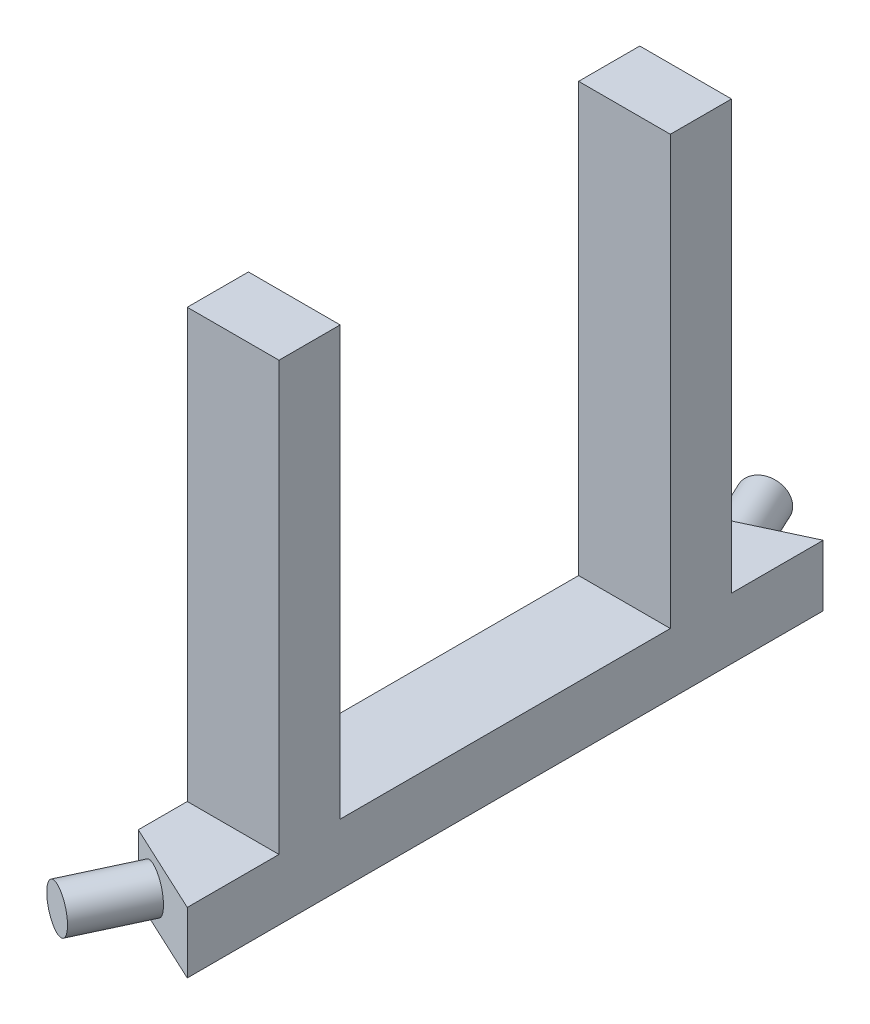
ISO-10303-21;
HEADER;
FILE_DESCRIPTION(('STEP AP214'),'2;1');
FILE_NAME('part.step','',(''),(''),'','','');
FILE_SCHEMA(('AUTOMOTIVE_DESIGN { 1 0 10303 214 1 1 1 1 }'));
ENDSEC;
DATA;
#1=APPLICATION_CONTEXT('core data for automotive mechanical design processes');
#2=APPLICATION_PROTOCOL_DEFINITION('international standard','automotive_design',2000,#1);
#3=PRODUCT_CONTEXT('',#1,'mechanical');
#4=PRODUCT('Part','Part','',(#3));
#5=PRODUCT_RELATED_PRODUCT_CATEGORY('part','',(#4));
#6=PRODUCT_DEFINITION_FORMATION('','',#4);
#7=PRODUCT_DEFINITION_CONTEXT('part definition',#1,'design');
#8=PRODUCT_DEFINITION('design','',#6,#7);
#9=PRODUCT_DEFINITION_SHAPE('','',#8);
#10=(LENGTH_UNIT() NAMED_UNIT(*) SI_UNIT(.MILLI.,.METRE.));
#11=(NAMED_UNIT(*) PLANE_ANGLE_UNIT() SI_UNIT($,.RADIAN.));
#12=(NAMED_UNIT(*) SI_UNIT($,.STERADIAN.) SOLID_ANGLE_UNIT());
#13=UNCERTAINTY_MEASURE_WITH_UNIT(LENGTH_MEASURE(1.E-05),#10,'distance_accuracy_value','');
#14=(GEOMETRIC_REPRESENTATION_CONTEXT(3) GLOBAL_UNCERTAINTY_ASSIGNED_CONTEXT((#13)) GLOBAL_UNIT_ASSIGNED_CONTEXT((#10,
#11,#12)) REPRESENTATION_CONTEXT('',''));
#15=CARTESIAN_POINT('',(0.,0.,0.));
#16=DIRECTION('',(0.,0.,1.));
#17=DIRECTION('',(1.,0.,0.));
#18=AXIS2_PLACEMENT_3D('',#15,#16,#17);
#19=CARTESIAN_POINT('',(0.,25.4,132.08));
#20=DIRECTION('',(0.,-1.,0.));
#21=DIRECTION('',(0.,0.,-1.));
#22=AXIS2_PLACEMENT_3D('',#19,#20,#21);
#23=PLANE('',#22);
#24=DIRECTION('',(-0.906307787036652,0.,0.422618261740694));
#25=VECTOR('',#24,1.);
#26=CARTESIAN_POINT('',(-12.1060333579969,25.4,-108.668542159581));
#27=LINE('',#26,#25);
#28=CARTESIAN_POINT('',(38.1,25.4,-132.08));
#29=VERTEX_POINT('',#28);
#30=CARTESIAN_POINT('',(0.,25.4,-114.313678224295));
#31=VERTEX_POINT('',#30);
#32=EDGE_CURVE('E132',#29,#31,#27,.T.);
#33=ORIENTED_EDGE('',*,*,#32,.T.);
#34=DIRECTION('',(0.,0.,-1.));
#35=VECTOR('',#34,1.);
#36=CARTESIAN_POINT('',(0.,25.4,132.08));
#37=LINE('',#36,#35);
#38=CARTESIAN_POINT('',(0.,25.4,-93.98));
#39=VERTEX_POINT('',#38);
#40=EDGE_CURVE('E55',#39,#31,#37,.T.);
#41=ORIENTED_EDGE('',*,*,#40,.F.);
#42=DIRECTION('',(1.,0.,0.));
#43=VECTOR('',#42,1.);
#44=CARTESIAN_POINT('',(38.1,25.4,-93.98));
#45=LINE('',#44,#43);
#46=CARTESIAN_POINT('',(38.1,25.4,-93.98));
#47=VERTEX_POINT('',#46);
#48=EDGE_CURVE('E223',#39,#47,#45,.T.);
#49=ORIENTED_EDGE('',*,*,#48,.T.);
#50=DIRECTION('',(0.,0.,-1.));
#51=VECTOR('',#50,1.);
#52=CARTESIAN_POINT('',(38.1,25.4,132.08));
#53=LINE('',#52,#51);
#54=EDGE_CURVE('E141',#47,#29,#53,.T.);
#55=ORIENTED_EDGE('',*,*,#54,.T.);
#56=EDGE_LOOP('',(#33,#41,#49,#55));
#57=FACE_BOUND('',#56,.T.);
#58=ADVANCED_FACE('F39',(#57),#23,.F.);
#59=CARTESIAN_POINT('',(0.,0.,132.08));
#60=DIRECTION('',(1.,0.,0.));
#61=DIRECTION('',(0.,1.,0.));
#62=AXIS2_PLACEMENT_3D('',#59,#60,#61);
#63=PLANE('',#62);
#64=DIRECTION('',(0.,-1.,0.));
#65=VECTOR('',#64,1.);
#66=CARTESIAN_POINT('',(0.,-0.000999999999998987,-114.313678224295));
#67=LINE('',#66,#65);
#68=CARTESIAN_POINT('',(0.,0.,-114.313678224295));
#69=VERTEX_POINT('',#68);
#70=EDGE_CURVE('E130',#31,#69,#67,.T.);
#71=ORIENTED_EDGE('',*,*,#70,.T.);
#72=DIRECTION('',(0.,0.,-1.));
#73=VECTOR('',#72,1.);
#74=CARTESIAN_POINT('',(0.,0.,132.08));
#75=LINE('',#74,#73);
#76=CARTESIAN_POINT('',(0.,0.,114.313678224295));
#77=VERTEX_POINT('',#76);
#78=EDGE_CURVE('E43',#77,#69,#75,.T.);
#79=ORIENTED_EDGE('',*,*,#78,.F.);
#80=DIRECTION('',(0.,-1.,0.));
#81=VECTOR('',#80,1.);
#82=CARTESIAN_POINT('',(0.,-0.000999999999998987,114.313678224295));
#83=LINE('',#82,#81);
#84=CARTESIAN_POINT('',(0.,25.4,114.313678224295));
#85=VERTEX_POINT('',#84);
#86=EDGE_CURVE('E173',#85,#77,#83,.T.);
#87=ORIENTED_EDGE('',*,*,#86,.F.);
#88=CARTESIAN_POINT('',(0.,25.4,93.98));
#89=VERTEX_POINT('',#88);
#90=EDGE_CURVE('E150',#85,#89,#37,.T.);
#91=ORIENTED_EDGE('',*,*,#90,.T.);
#92=DIRECTION('',(0.,-1.,0.));
#93=VECTOR('',#92,1.);
#94=CARTESIAN_POINT('',(0.,203.2,93.98));
#95=LINE('',#94,#93);
#96=CARTESIAN_POINT('',(0.,203.2,93.98));
#97=VERTEX_POINT('',#96);
#98=EDGE_CURVE('E151',#97,#89,#95,.T.);
#99=ORIENTED_EDGE('',*,*,#98,.F.);
#100=DIRECTION('',(0.,0.,1.));
#101=VECTOR('',#100,1.);
#102=CARTESIAN_POINT('',(0.,203.2,93.98));
#103=LINE('',#102,#101);
#104=CARTESIAN_POINT('',(0.,203.2,68.58));
#105=VERTEX_POINT('',#104);
#106=EDGE_CURVE('E202',#105,#97,#103,.T.);
#107=ORIENTED_EDGE('',*,*,#106,.F.);
#108=DIRECTION('',(0.,-1.,0.));
#109=VECTOR('',#108,1.);
#110=CARTESIAN_POINT('',(0.,203.2,68.58));
#111=LINE('',#110,#109);
#112=CARTESIAN_POINT('',(0.,25.4,68.58));
#113=VERTEX_POINT('',#112);
#114=EDGE_CURVE('E197',#105,#113,#111,.T.);
#115=ORIENTED_EDGE('',*,*,#114,.T.);
#116=CARTESIAN_POINT('',(0.,25.4,-68.58));
#117=VERTEX_POINT('',#116);
#118=EDGE_CURVE('E147',#113,#117,#37,.T.);
#119=ORIENTED_EDGE('',*,*,#118,.T.);
#120=DIRECTION('',(0.,-1.,0.));
#121=VECTOR('',#120,1.);
#122=CARTESIAN_POINT('',(0.,203.2,-68.58));
#123=LINE('',#122,#121);
#124=CARTESIAN_POINT('',(0.,203.2,-68.58));
#125=VERTEX_POINT('',#124);
#126=EDGE_CURVE('E212',#125,#117,#123,.T.);
#127=ORIENTED_EDGE('',*,*,#126,.F.);
#128=DIRECTION('',(0.,0.,-1.));
#129=VECTOR('',#128,1.);
#130=CARTESIAN_POINT('',(0.,203.2,-93.98));
#131=LINE('',#130,#129);
#132=CARTESIAN_POINT('',(0.,203.2,-93.98));
#133=VERTEX_POINT('',#132);
#134=EDGE_CURVE('E225',#125,#133,#131,.T.);
#135=ORIENTED_EDGE('',*,*,#134,.T.);
#136=DIRECTION('',(0.,-1.,0.));
#137=VECTOR('',#136,1.);
#138=CARTESIAN_POINT('',(0.,203.2,-93.98));
#139=LINE('',#138,#137);
#140=EDGE_CURVE('E145',#133,#39,#139,.T.);
#141=ORIENTED_EDGE('',*,*,#140,.T.);
#142=ORIENTED_EDGE('',*,*,#40,.T.);
#143=EDGE_LOOP('',(#71,#79,#87,#91,#99,#107,#115,#119,#127,#135,#141,#142));
#144=FACE_BOUND('',#143,.T.);
#145=ADVANCED_FACE('F41',(#144),#63,.F.);
#146=CARTESIAN_POINT('',(0.,0.,132.08));
#147=DIRECTION('',(0.,1.,0.));
#148=DIRECTION('',(0.,0.,1.));
#149=AXIS2_PLACEMENT_3D('',#146,#147,#148);
#150=PLANE('',#149);
#151=DIRECTION('',(0.906307787036653,0.,-0.422618261740694));
#152=VECTOR('',#151,1.);
#153=CARTESIAN_POINT('',(-12.1060333579969,0.,-108.668542159581));
#154=LINE('',#153,#152);
#155=CARTESIAN_POINT('',(38.1,0.,-132.08));
#156=VERTEX_POINT('',#155);
#157=EDGE_CURVE('E135',#69,#156,#154,.T.);
#158=ORIENTED_EDGE('',*,*,#157,.T.);
#159=DIRECTION('',(0.,0.,-1.));
#160=VECTOR('',#159,1.);
#161=CARTESIAN_POINT('',(38.1,0.,132.08));
#162=LINE('',#161,#160);
#163=CARTESIAN_POINT('',(38.1,0.,132.08));
#164=VERTEX_POINT('',#163);
#165=EDGE_CURVE('E160',#164,#156,#162,.T.);
#166=ORIENTED_EDGE('',*,*,#165,.F.);
#167=DIRECTION('',(0.906307787036653,0.,0.422618261740694));
#168=VECTOR('',#167,1.);
#169=CARTESIAN_POINT('',(-12.1060333579969,0.,108.668542159581));
#170=LINE('',#169,#168);
#171=EDGE_CURVE('E172',#77,#164,#170,.T.);
#172=ORIENTED_EDGE('',*,*,#171,.F.);
#173=ORIENTED_EDGE('',*,*,#78,.T.);
#174=EDGE_LOOP('',(#158,#166,#172,#173));
#175=FACE_BOUND('',#174,.T.);
#176=ADVANCED_FACE('F171',(#175),#150,.F.);
#177=CARTESIAN_POINT('',(38.1,25.4,68.58));
#178=VERTEX_POINT('',#177);
#179=CARTESIAN_POINT('',(38.1,25.4,-68.58));
#180=VERTEX_POINT('',#179);
#181=EDGE_CURVE('E158',#178,#180,#53,.T.);
#182=ORIENTED_EDGE('',*,*,#181,.T.);
#183=DIRECTION('',(-1.,0.,0.));
#184=VECTOR('',#183,1.);
#185=CARTESIAN_POINT('',(38.1,25.4,-68.58));
#186=LINE('',#185,#184);
#187=EDGE_CURVE('E63',#180,#117,#186,.T.);
#188=ORIENTED_EDGE('',*,*,#187,.T.);
#189=ORIENTED_EDGE('',*,*,#118,.F.);
#190=DIRECTION('',(-1.,0.,0.));
#191=VECTOR('',#190,1.);
#192=CARTESIAN_POINT('',(38.1,25.4,68.58));
#193=LINE('',#192,#191);
#194=EDGE_CURVE('E184',#178,#113,#193,.T.);
#195=ORIENTED_EDGE('',*,*,#194,.F.);
#196=EDGE_LOOP('',(#182,#188,#189,#195));
#197=FACE_BOUND('',#196,.T.);
#198=ADVANCED_FACE('F259',(#197),#23,.F.);
#199=ORIENTED_EDGE('',*,*,#90,.F.);
#200=DIRECTION('',(-0.906307787036652,0.,-0.422618261740694));
#201=VECTOR('',#200,1.);
#202=CARTESIAN_POINT('',(-12.1060333579969,25.4,108.668542159581));
#203=LINE('',#202,#201);
#204=CARTESIAN_POINT('',(38.1,25.4,132.08));
#205=VERTEX_POINT('',#204);
#206=EDGE_CURVE('E175',#205,#85,#203,.T.);
#207=ORIENTED_EDGE('',*,*,#206,.F.);
#208=CARTESIAN_POINT('',(38.1,25.4,93.98));
#209=VERTEX_POINT('',#208);
#210=EDGE_CURVE('E159',#205,#209,#53,.T.);
#211=ORIENTED_EDGE('',*,*,#210,.T.);
#212=DIRECTION('',(1.,0.,0.));
#213=VECTOR('',#212,1.);
#214=CARTESIAN_POINT('',(38.1,25.4,93.98));
#215=LINE('',#214,#213);
#216=EDGE_CURVE('E179',#89,#209,#215,.T.);
#217=ORIENTED_EDGE('',*,*,#216,.F.);
#218=EDGE_LOOP('',(#199,#207,#211,#217));
#219=FACE_BOUND('',#218,.T.);
#220=ADVANCED_FACE('F178',(#219),#23,.F.);
#221=CARTESIAN_POINT('',(38.1,0.,132.08));
#222=DIRECTION('',(-1.,0.,0.));
#223=DIRECTION('',(0.,0.,1.));
#224=AXIS2_PLACEMENT_3D('',#221,#222,#223);
#225=PLANE('',#224);
#226=ORIENTED_EDGE('',*,*,#165,.T.);
#227=DIRECTION('',(0.,1.,0.));
#228=VECTOR('',#227,1.);
#229=CARTESIAN_POINT('',(38.1,0.,-132.08));
#230=LINE('',#229,#228);
#231=EDGE_CURVE('E176',#156,#29,#230,.T.);
#232=ORIENTED_EDGE('',*,*,#231,.T.);
#233=ORIENTED_EDGE('',*,*,#54,.F.);
#234=DIRECTION('',(0.,-1.,0.));
#235=VECTOR('',#234,1.);
#236=CARTESIAN_POINT('',(38.1,203.2,-93.98));
#237=LINE('',#236,#235);
#238=CARTESIAN_POINT('',(38.1,203.2,-93.98));
#239=VERTEX_POINT('',#238);
#240=EDGE_CURVE('E218',#239,#47,#237,.T.);
#241=ORIENTED_EDGE('',*,*,#240,.F.);
#242=DIRECTION('',(0.,0.,1.));
#243=VECTOR('',#242,1.);
#244=CARTESIAN_POINT('',(38.1,203.2,-93.98));
#245=LINE('',#244,#243);
#246=CARTESIAN_POINT('',(38.1,203.2,-68.58));
#247=VERTEX_POINT('',#246);
#248=EDGE_CURVE('E229',#239,#247,#245,.T.);
#249=ORIENTED_EDGE('',*,*,#248,.T.);
#250=DIRECTION('',(0.,-1.,0.));
#251=VECTOR('',#250,1.);
#252=CARTESIAN_POINT('',(38.1,203.2,-68.58));
#253=LINE('',#252,#251);
#254=EDGE_CURVE('E215',#247,#180,#253,.T.);
#255=ORIENTED_EDGE('',*,*,#254,.T.);
#256=ORIENTED_EDGE('',*,*,#181,.F.);
#257=DIRECTION('',(0.,-1.,0.));
#258=VECTOR('',#257,1.);
#259=CARTESIAN_POINT('',(38.1,203.2,68.58));
#260=LINE('',#259,#258);
#261=CARTESIAN_POINT('',(38.1,203.2,68.58));
#262=VERTEX_POINT('',#261);
#263=EDGE_CURVE('E192',#262,#178,#260,.T.);
#264=ORIENTED_EDGE('',*,*,#263,.F.);
#265=DIRECTION('',(0.,0.,-1.));
#266=VECTOR('',#265,1.);
#267=CARTESIAN_POINT('',(38.1,203.2,93.98));
#268=LINE('',#267,#266);
#269=CARTESIAN_POINT('',(38.1,203.2,93.98));
#270=VERTEX_POINT('',#269);
#271=EDGE_CURVE('E205',#270,#262,#268,.T.);
#272=ORIENTED_EDGE('',*,*,#271,.F.);
#273=DIRECTION('',(0.,-1.,0.));
#274=VECTOR('',#273,1.);
#275=CARTESIAN_POINT('',(38.1,203.2,93.98));
#276=LINE('',#275,#274);
#277=EDGE_CURVE('E190',#270,#209,#276,.T.);
#278=ORIENTED_EDGE('',*,*,#277,.T.);
#279=ORIENTED_EDGE('',*,*,#210,.F.);
#280=DIRECTION('',(0.,1.,0.));
#281=VECTOR('',#280,1.);
#282=CARTESIAN_POINT('',(38.1,0.,132.08));
#283=LINE('',#282,#281);
#284=EDGE_CURVE('E148',#164,#205,#283,.T.);
#285=ORIENTED_EDGE('',*,*,#284,.F.);
#286=EDGE_LOOP('',(#226,#232,#233,#241,#249,#255,#256,#264,#272,#278,#279,#285));
#287=FACE_BOUND('',#286,.T.);
#288=ADVANCED_FACE('F267',(#287),#225,.F.);
#289=CARTESIAN_POINT('',(38.1,203.2,93.98));
#290=DIRECTION('',(0.,0.,-1.));
#291=DIRECTION('',(-1.,0.,0.));
#292=AXIS2_PLACEMENT_3D('',#289,#290,#291);
#293=PLANE('',#292);
#294=ORIENTED_EDGE('',*,*,#216,.T.);
#295=ORIENTED_EDGE('',*,*,#277,.F.);
#296=DIRECTION('',(1.,0.,0.));
#297=VECTOR('',#296,1.);
#298=CARTESIAN_POINT('',(38.1,203.2,93.98));
#299=LINE('',#298,#297);
#300=EDGE_CURVE('E187',#97,#270,#299,.T.);
#301=ORIENTED_EDGE('',*,*,#300,.F.);
#302=ORIENTED_EDGE('',*,*,#98,.T.);
#303=EDGE_LOOP('',(#294,#295,#301,#302));
#304=FACE_BOUND('',#303,.T.);
#305=ADVANCED_FACE('F186',(#304),#293,.F.);
#306=CARTESIAN_POINT('',(38.1,203.2,68.58));
#307=DIRECTION('',(0.,0.,1.));
#308=DIRECTION('',(1.,0.,0.));
#309=AXIS2_PLACEMENT_3D('',#306,#307,#308);
#310=PLANE('',#309);
#311=ORIENTED_EDGE('',*,*,#194,.T.);
#312=ORIENTED_EDGE('',*,*,#114,.F.);
#313=DIRECTION('',(-1.,0.,0.));
#314=VECTOR('',#313,1.);
#315=CARTESIAN_POINT('',(38.1,203.2,68.58));
#316=LINE('',#315,#314);
#317=EDGE_CURVE('E200',#262,#105,#316,.T.);
#318=ORIENTED_EDGE('',*,*,#317,.F.);
#319=ORIENTED_EDGE('',*,*,#263,.T.);
#320=EDGE_LOOP('',(#311,#312,#318,#319));
#321=FACE_BOUND('',#320,.T.);
#322=ADVANCED_FACE('F274',(#321),#310,.F.);
#323=CARTESIAN_POINT('',(0.,203.2,0.));
#324=DIRECTION('',(0.,1.,0.));
#325=DIRECTION('',(0.,0.,1.));
#326=AXIS2_PLACEMENT_3D('',#323,#324,#325);
#327=PLANE('',#326);
#328=ORIENTED_EDGE('',*,*,#106,.T.);
#329=ORIENTED_EDGE('',*,*,#300,.T.);
#330=ORIENTED_EDGE('',*,*,#271,.T.);
#331=ORIENTED_EDGE('',*,*,#317,.T.);
#332=EDGE_LOOP('',(#328,#329,#330,#331));
#333=FACE_BOUND('',#332,.T.);
#334=ADVANCED_FACE('F335',(#333),#327,.T.);
#335=CARTESIAN_POINT('',(-12.1060333579969,-0.001000000000001,108.668542159581));
#336=DIRECTION('',(0.422618261740694,0.,-0.906307787036653));
#337=DIRECTION('',(-0.906307787036653,0.,-0.422618261740694));
#338=AXIS2_PLACEMENT_3D('',#335,#336,#337);
#339=PLANE('',#338);
#340=CARTESIAN_POINT('',(11.5101088953655,12.7,119.680930148402));
#341=DIRECTION('',(-0.422618261740694,0.,0.906307787036653));
#342=DIRECTION('',(0.906307787036653,0.,0.422618261740694));
#343=AXIS2_PLACEMENT_3D('',#340,#341,#342);
#344=CIRCLE('',#343,8.88999999999999);
#345=CARTESIAN_POINT('',(19.5671851221213,12.7,123.438006495276));
#346=VERTEX_POINT('',#345);
#347=EDGE_CURVE('E11',#346,#346,#344,.T.);
#348=ORIENTED_EDGE('',*,*,#347,.F.);
#349=EDGE_LOOP('',(#348));
#350=FACE_BOUND('',#349,.T.);
#351=ORIENTED_EDGE('',*,*,#86,.T.);
#352=ORIENTED_EDGE('',*,*,#171,.T.);
#353=ORIENTED_EDGE('',*,*,#284,.T.);
#354=ORIENTED_EDGE('',*,*,#206,.T.);
#355=EDGE_LOOP('',(#351,#352,#353,#354));
#356=FACE_BOUND('',#355,.T.);
#357=ADVANCED_FACE('F302',(#350,#356),#339,.F.);
#358=CARTESIAN_POINT('',(38.1,203.2,-68.58));
#359=DIRECTION('',(0.,0.,1.));
#360=DIRECTION('',(1.,0.,0.));
#361=AXIS2_PLACEMENT_3D('',#358,#359,#360);
#362=PLANE('',#361);
#363=ORIENTED_EDGE('',*,*,#187,.F.);
#364=ORIENTED_EDGE('',*,*,#254,.F.);
#365=DIRECTION('',(-1.,0.,0.));
#366=VECTOR('',#365,1.);
#367=CARTESIAN_POINT('',(38.1,203.2,-68.58));
#368=LINE('',#367,#366);
#369=EDGE_CURVE('E232',#247,#125,#368,.T.);
#370=ORIENTED_EDGE('',*,*,#369,.T.);
#371=ORIENTED_EDGE('',*,*,#126,.T.);
#372=EDGE_LOOP('',(#363,#364,#370,#371));
#373=FACE_BOUND('',#372,.T.);
#374=ADVANCED_FACE('F297',(#373),#362,.T.);
#375=CARTESIAN_POINT('',(38.1,203.2,-93.98));
#376=DIRECTION('',(0.,0.,-1.));
#377=DIRECTION('',(-1.,0.,0.));
#378=AXIS2_PLACEMENT_3D('',#375,#376,#377);
#379=PLANE('',#378);
#380=ORIENTED_EDGE('',*,*,#48,.F.);
#381=ORIENTED_EDGE('',*,*,#140,.F.);
#382=DIRECTION('',(1.,0.,0.));
#383=VECTOR('',#382,1.);
#384=CARTESIAN_POINT('',(38.1,203.2,-93.98));
#385=LINE('',#384,#383);
#386=EDGE_CURVE('E222',#133,#239,#385,.T.);
#387=ORIENTED_EDGE('',*,*,#386,.T.);
#388=ORIENTED_EDGE('',*,*,#240,.T.);
#389=EDGE_LOOP('',(#380,#381,#387,#388));
#390=FACE_BOUND('',#389,.T.);
#391=ADVANCED_FACE('F301',(#390),#379,.T.);
#392=CARTESIAN_POINT('',(0.,203.2,0.));
#393=DIRECTION('',(0.,1.,0.));
#394=DIRECTION('',(0.,0.,-1.));
#395=AXIS2_PLACEMENT_3D('',#392,#393,#394);
#396=PLANE('',#395);
#397=ORIENTED_EDGE('',*,*,#134,.F.);
#398=ORIENTED_EDGE('',*,*,#369,.F.);
#399=ORIENTED_EDGE('',*,*,#248,.F.);
#400=ORIENTED_EDGE('',*,*,#386,.F.);
#401=EDGE_LOOP('',(#397,#398,#399,#400));
#402=FACE_BOUND('',#401,.T.);
#403=ADVANCED_FACE('F313',(#402),#396,.T.);
#404=CARTESIAN_POINT('',(-12.1060333579969,-0.001000000000001,-108.668542159581));
#405=DIRECTION('',(-0.422618261740694,0.,-0.906307787036653));
#406=DIRECTION('',(-0.906307787036653,0.,0.422618261740694));
#407=AXIS2_PLACEMENT_3D('',#404,#405,#406);
#408=PLANE('',#407);
#409=CARTESIAN_POINT('',(11.5101088953655,12.7,-119.680930148402));
#410=DIRECTION('',(0.422618261740694,0.,0.906307787036653));
#411=DIRECTION('',(0.906307787036653,0.,-0.422618261740694));
#412=AXIS2_PLACEMENT_3D('',#409,#410,#411);
#413=CIRCLE('',#412,8.88999999999999);
#414=CARTESIAN_POINT('',(19.5671851221213,12.7,-123.438006495276));
#415=VERTEX_POINT('',#414);
#416=EDGE_CURVE('E240',#415,#415,#413,.T.);
#417=ORIENTED_EDGE('',*,*,#416,.T.);
#418=EDGE_LOOP('',(#417));
#419=FACE_BOUND('',#418,.T.);
#420=ORIENTED_EDGE('',*,*,#32,.F.);
#421=ORIENTED_EDGE('',*,*,#231,.F.);
#422=ORIENTED_EDGE('',*,*,#157,.F.);
#423=ORIENTED_EDGE('',*,*,#70,.F.);
#424=EDGE_LOOP('',(#420,#421,#422,#423));
#425=FACE_BOUND('',#424,.T.);
#426=ADVANCED_FACE('F131',(#419,#425),#408,.T.);
#427=CARTESIAN_POINT('',(-1.16843895685532,12.7,146.870163759501));
#428=DIRECTION('',(0.422618261740694,0.,-0.906307787036653));
#429=DIRECTION('',(-0.906307787036653,0.,-0.422618261740694));
#430=AXIS2_PLACEMENT_3D('',#427,#428,#429);
#431=CYLINDRICAL_SURFACE('',#430,8.88999999999999);
#432=CARTESIAN_POINT('',(-1.16843895685532,12.7,146.870163759501));
#433=DIRECTION('',(-0.422618261740694,0.,0.906307787036653));
#434=DIRECTION('',(0.906307787036653,0.,0.422618261740694));
#435=AXIS2_PLACEMENT_3D('',#432,#433,#434);
#436=CIRCLE('',#435,8.88999999999999);
#437=CARTESIAN_POINT('',(6.88863726990051,12.7,150.627240106376));
#438=VERTEX_POINT('',#437);
#439=EDGE_CURVE('E139',#438,#438,#436,.T.);
#440=ORIENTED_EDGE('',*,*,#439,.F.);
#441=EDGE_LOOP('',(#440));
#442=FACE_BOUND('',#441,.T.);
#443=ORIENTED_EDGE('',*,*,#347,.T.);
#444=EDGE_LOOP('',(#443));
#445=FACE_BOUND('',#444,.T.);
#446=ADVANCED_FACE('F343',(#442,#445),#431,.T.);
#447=CARTESIAN_POINT('',(-1.16843895685532,12.7,146.870163759501));
#448=DIRECTION('',(-0.422618261740694,0.,0.906307787036653));
#449=DIRECTION('',(0.906307787036653,0.,0.422618261740694));
#450=AXIS2_PLACEMENT_3D('',#447,#448,#449);
#451=PLANE('',#450);
#452=ORIENTED_EDGE('',*,*,#439,.T.);
#453=EDGE_LOOP('',(#452));
#454=FACE_BOUND('',#453,.T.);
#455=ADVANCED_FACE('F255',(#454),#451,.T.);
#456=CARTESIAN_POINT('',(-1.16843895685532,12.7,-146.870163759501));
#457=DIRECTION('',(0.422618261740694,0.,0.906307787036653));
#458=DIRECTION('',(0.906307787036653,0.,-0.422618261740694));
#459=AXIS2_PLACEMENT_3D('',#456,#457,#458);
#460=CYLINDRICAL_SURFACE('',#459,8.88999999999999);
#461=CARTESIAN_POINT('',(-1.16843895685532,12.7,-146.870163759501));
#462=DIRECTION('',(0.422618261740694,0.,0.906307787036653));
#463=DIRECTION('',(0.906307787036653,0.,-0.422618261740694));
#464=AXIS2_PLACEMENT_3D('',#461,#462,#463);
#465=CIRCLE('',#464,8.88999999999999);
#466=CARTESIAN_POINT('',(6.88863726990051,12.7,-150.627240106376));
#467=VERTEX_POINT('',#466);
#468=EDGE_CURVE('E239',#467,#467,#465,.T.);
#469=ORIENTED_EDGE('',*,*,#468,.T.);
#470=EDGE_LOOP('',(#469));
#471=FACE_BOUND('',#470,.T.);
#472=ORIENTED_EDGE('',*,*,#416,.F.);
#473=EDGE_LOOP('',(#472));
#474=FACE_BOUND('',#473,.T.);
#475=ADVANCED_FACE('F246',(#471,#474),#460,.T.);
#476=CARTESIAN_POINT('',(-1.16843895685532,12.7,-146.870163759501));
#477=DIRECTION('',(-0.422618261740694,0.,-0.906307787036653));
#478=DIRECTION('',(0.906307787036653,0.,-0.422618261740694));
#479=AXIS2_PLACEMENT_3D('',#476,#477,#478);
#480=PLANE('',#479);
#481=ORIENTED_EDGE('',*,*,#468,.F.);
#482=EDGE_LOOP('',(#481));
#483=FACE_BOUND('',#482,.T.);
#484=ADVANCED_FACE('F249',(#483),#480,.T.);
#485=CLOSED_SHELL('',(#58,#145,#176,#198,#220,#288,#305,#322,#334,#357,#374,#391,#403,#426,#446,
#455,#475,#484));
#486=MANIFOLD_SOLID_BREP('B2',#485);
#487=ADVANCED_BREP_SHAPE_REPRESENTATION('',(#18,#486),#14);
#488=SHAPE_DEFINITION_REPRESENTATION(#9,#487);
ENDSEC;
END-ISO-10303-21;
